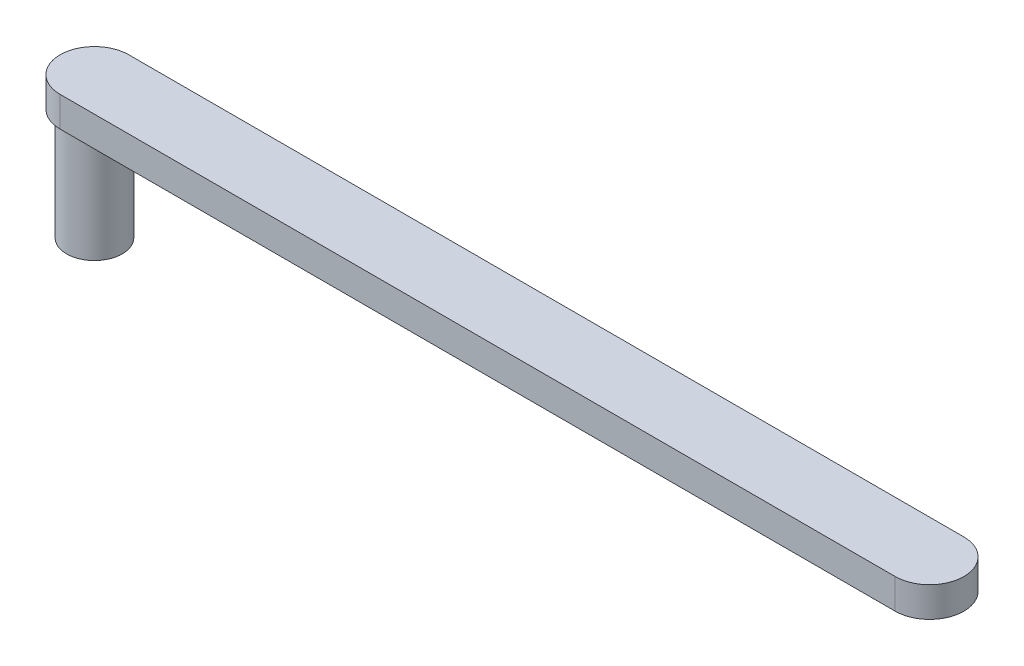
ISO-10303-21;
HEADER;
FILE_DESCRIPTION(('STEP AP214'),'2;1');
FILE_NAME('part.step','',(''),(''),'','','');
FILE_SCHEMA(('AUTOMOTIVE_DESIGN { 1 0 10303 214 1 1 1 1 }'));
ENDSEC;
DATA;
#1=APPLICATION_CONTEXT('core data for automotive mechanical design processes');
#2=APPLICATION_PROTOCOL_DEFINITION('international standard','automotive_design',2000,#1);
#3=PRODUCT_CONTEXT('',#1,'mechanical');
#4=PRODUCT('Part','Part','',(#3));
#5=PRODUCT_RELATED_PRODUCT_CATEGORY('part','',(#4));
#6=PRODUCT_DEFINITION_FORMATION('','',#4);
#7=PRODUCT_DEFINITION_CONTEXT('part definition',#1,'design');
#8=PRODUCT_DEFINITION('design','',#6,#7);
#9=PRODUCT_DEFINITION_SHAPE('','',#8);
#10=(LENGTH_UNIT() NAMED_UNIT(*) SI_UNIT(.MILLI.,.METRE.));
#11=(NAMED_UNIT(*) PLANE_ANGLE_UNIT() SI_UNIT($,.RADIAN.));
#12=(NAMED_UNIT(*) SI_UNIT($,.STERADIAN.) SOLID_ANGLE_UNIT());
#13=UNCERTAINTY_MEASURE_WITH_UNIT(LENGTH_MEASURE(1.E-05),#10,'distance_accuracy_value','');
#14=(GEOMETRIC_REPRESENTATION_CONTEXT(3) GLOBAL_UNCERTAINTY_ASSIGNED_CONTEXT((#13)) GLOBAL_UNIT_ASSIGNED_CONTEXT((#10,
#11,#12)) REPRESENTATION_CONTEXT('',''));
#15=CARTESIAN_POINT('',(0.,0.,0.));
#16=DIRECTION('',(0.,0.,1.));
#17=DIRECTION('',(1.,0.,0.));
#18=AXIS2_PLACEMENT_3D('',#15,#16,#17);
#19=CARTESIAN_POINT('',(0.,50.8,0.));
#20=DIRECTION('',(0.,-1.,0.));
#21=DIRECTION('',(0.,0.,-1.));
#22=AXIS2_PLACEMENT_3D('',#19,#20,#21);
#23=CYLINDRICAL_SURFACE('',#22,12.7);
#24=CARTESIAN_POINT('',(0.,50.8,0.));
#25=DIRECTION('',(0.,1.,0.));
#26=DIRECTION('',(0.,0.,1.));
#27=AXIS2_PLACEMENT_3D('',#24,#25,#26);
#28=CIRCLE('',#27,12.7);
#29=CARTESIAN_POINT('',(0.,50.8,12.7));
#30=VERTEX_POINT('',#29);
#31=EDGE_CURVE('E11',#30,#30,#28,.T.);
#32=ORIENTED_EDGE('',*,*,#31,.F.);
#33=EDGE_LOOP('',(#32));
#34=FACE_BOUND('',#33,.T.);
#35=CARTESIAN_POINT('',(0.,0.,0.));
#36=DIRECTION('',(0.,1.,0.));
#37=DIRECTION('',(0.,0.,1.));
#38=AXIS2_PLACEMENT_3D('',#35,#36,#37);
#39=CIRCLE('',#38,12.7);
#40=CARTESIAN_POINT('',(0.,0.,12.7));
#41=VERTEX_POINT('',#40);
#42=EDGE_CURVE('E35',#41,#41,#39,.T.);
#43=ORIENTED_EDGE('',*,*,#42,.T.);
#44=EDGE_LOOP('',(#43));
#45=FACE_BOUND('',#44,.T.);
#46=ADVANCED_FACE('F32',(#34,#45),#23,.T.);
#47=CARTESIAN_POINT('',(0.,0.,0.));
#48=DIRECTION('',(0.,1.,0.));
#49=DIRECTION('',(0.,0.,1.));
#50=AXIS2_PLACEMENT_3D('',#47,#48,#49);
#51=PLANE('',#50);
#52=ORIENTED_EDGE('',*,*,#42,.F.);
#53=EDGE_LOOP('',(#52));
#54=FACE_BOUND('',#53,.T.);
#55=ADVANCED_FACE('F111',(#54),#51,.F.);
#56=CARTESIAN_POINT('',(0.,64.516,0.));
#57=DIRECTION('',(0.,-1.,0.));
#58=DIRECTION('',(0.,0.,-1.));
#59=AXIS2_PLACEMENT_3D('',#56,#57,#58);
#60=CYLINDRICAL_SURFACE('',#59,15.6552680081461);
#61=CARTESIAN_POINT('',(0.,50.8,0.));
#62=DIRECTION('',(0.,1.,0.));
#63=DIRECTION('',(0.,0.,1.));
#64=AXIS2_PLACEMENT_3D('',#61,#62,#63);
#65=CIRCLE('',#64,15.6552680081461);
#66=CARTESIAN_POINT('',(0.,50.8,-15.6552680081461));
#67=VERTEX_POINT('',#66);
#68=CARTESIAN_POINT('',(0.,50.8,15.6552680081461));
#69=VERTEX_POINT('',#68);
#70=EDGE_CURVE('E99',#67,#69,#65,.T.);
#71=ORIENTED_EDGE('',*,*,#70,.T.);
#72=DIRECTION('',(0.,-1.,0.));
#73=VECTOR('',#72,1.);
#74=CARTESIAN_POINT('',(0.,64.516,15.6552680081461));
#75=LINE('',#74,#73);
#76=CARTESIAN_POINT('',(0.,64.516,15.6552680081461));
#77=VERTEX_POINT('',#76);
#78=EDGE_CURVE('E90',#77,#69,#75,.T.);
#79=ORIENTED_EDGE('',*,*,#78,.F.);
#80=CARTESIAN_POINT('',(0.,64.516,0.));
#81=DIRECTION('',(0.,1.,0.));
#82=DIRECTION('',(0.,0.,1.));
#83=AXIS2_PLACEMENT_3D('',#80,#81,#82);
#84=CIRCLE('',#83,15.6552680081461);
#85=CARTESIAN_POINT('',(0.,64.516,-15.6552680081461));
#86=VERTEX_POINT('',#85);
#87=EDGE_CURVE('E84',#86,#77,#84,.T.);
#88=ORIENTED_EDGE('',*,*,#87,.F.);
#89=DIRECTION('',(0.,-1.,0.));
#90=VECTOR('',#89,1.);
#91=CARTESIAN_POINT('',(0.,64.516,-15.6552680081461));
#92=LINE('',#91,#90);
#93=EDGE_CURVE('E95',#86,#67,#92,.T.);
#94=ORIENTED_EDGE('',*,*,#93,.T.);
#95=EDGE_LOOP('',(#71,#79,#88,#94));
#96=FACE_BOUND('',#95,.T.);
#97=ADVANCED_FACE('F113',(#96),#60,.T.);
#98=CARTESIAN_POINT('',(0.,64.516,15.6552680081461));
#99=DIRECTION('',(0.,0.,-1.));
#100=DIRECTION('',(-1.,0.,0.));
#101=AXIS2_PLACEMENT_3D('',#98,#99,#100);
#102=PLANE('',#101);
#103=DIRECTION('',(1.,0.,0.));
#104=VECTOR('',#103,1.);
#105=CARTESIAN_POINT('',(0.,50.8,15.6552680081461));
#106=LINE('',#105,#104);
#107=CARTESIAN_POINT('',(381.,50.8,15.6552680081461));
#108=VERTEX_POINT('',#107);
#109=EDGE_CURVE('E89',#69,#108,#106,.T.);
#110=ORIENTED_EDGE('',*,*,#109,.T.);
#111=DIRECTION('',(0.,-1.,0.));
#112=VECTOR('',#111,1.);
#113=CARTESIAN_POINT('',(381.,64.516,15.6552680081461));
#114=LINE('',#113,#112);
#115=CARTESIAN_POINT('',(381.,64.516,15.6552680081461));
#116=VERTEX_POINT('',#115);
#117=EDGE_CURVE('E87',#116,#108,#114,.T.);
#118=ORIENTED_EDGE('',*,*,#117,.F.);
#119=DIRECTION('',(1.,0.,0.));
#120=VECTOR('',#119,1.);
#121=CARTESIAN_POINT('',(0.,64.516,15.6552680081461));
#122=LINE('',#121,#120);
#123=EDGE_CURVE('E79',#77,#116,#122,.T.);
#124=ORIENTED_EDGE('',*,*,#123,.F.);
#125=ORIENTED_EDGE('',*,*,#78,.T.);
#126=EDGE_LOOP('',(#110,#118,#124,#125));
#127=FACE_BOUND('',#126,.T.);
#128=ADVANCED_FACE('F88',(#127),#102,.F.);
#129=CARTESIAN_POINT('',(381.,64.516,0.));
#130=DIRECTION('',(0.,-1.,0.));
#131=DIRECTION('',(0.,0.,-1.));
#132=AXIS2_PLACEMENT_3D('',#129,#130,#131);
#133=CYLINDRICAL_SURFACE('',#132,15.6552680081461);
#134=CARTESIAN_POINT('',(381.,50.8,0.));
#135=DIRECTION('',(0.,1.,0.));
#136=DIRECTION('',(0.,0.,1.));
#137=AXIS2_PLACEMENT_3D('',#134,#135,#136);
#138=CIRCLE('',#137,15.6552680081461);
#139=CARTESIAN_POINT('',(381.,50.8,-15.6552680081461));
#140=VERTEX_POINT('',#139);
#141=EDGE_CURVE('E65',#108,#140,#138,.T.);
#142=ORIENTED_EDGE('',*,*,#141,.T.);
#143=DIRECTION('',(0.,-1.,0.));
#144=VECTOR('',#143,1.);
#145=CARTESIAN_POINT('',(381.,64.516,-15.6552680081461));
#146=LINE('',#145,#144);
#147=CARTESIAN_POINT('',(381.,64.516,-15.6552680081461));
#148=VERTEX_POINT('',#147);
#149=EDGE_CURVE('E91',#148,#140,#146,.T.);
#150=ORIENTED_EDGE('',*,*,#149,.F.);
#151=CARTESIAN_POINT('',(381.,64.516,0.));
#152=DIRECTION('',(0.,1.,0.));
#153=DIRECTION('',(0.,0.,1.));
#154=AXIS2_PLACEMENT_3D('',#151,#152,#153);
#155=CIRCLE('',#154,15.6552680081461);
#156=EDGE_CURVE('E82',#116,#148,#155,.T.);
#157=ORIENTED_EDGE('',*,*,#156,.F.);
#158=ORIENTED_EDGE('',*,*,#117,.T.);
#159=EDGE_LOOP('',(#142,#150,#157,#158));
#160=FACE_BOUND('',#159,.T.);
#161=ADVANCED_FACE('F93',(#160),#133,.T.);
#162=CARTESIAN_POINT('',(0.,64.516,-15.6552680081461));
#163=DIRECTION('',(0.,0.,1.));
#164=DIRECTION('',(1.,0.,0.));
#165=AXIS2_PLACEMENT_3D('',#162,#163,#164);
#166=PLANE('',#165);
#167=DIRECTION('',(-1.,0.,0.));
#168=VECTOR('',#167,1.);
#169=CARTESIAN_POINT('',(0.,50.8,-15.6552680081461));
#170=LINE('',#169,#168);
#171=EDGE_CURVE('E71',#140,#67,#170,.T.);
#172=ORIENTED_EDGE('',*,*,#171,.T.);
#173=ORIENTED_EDGE('',*,*,#93,.F.);
#174=DIRECTION('',(-1.,0.,0.));
#175=VECTOR('',#174,1.);
#176=CARTESIAN_POINT('',(0.,64.516,-15.6552680081461));
#177=LINE('',#176,#175);
#178=EDGE_CURVE('E48',#148,#86,#177,.T.);
#179=ORIENTED_EDGE('',*,*,#178,.F.);
#180=ORIENTED_EDGE('',*,*,#149,.T.);
#181=EDGE_LOOP('',(#172,#173,#179,#180));
#182=FACE_BOUND('',#181,.T.);
#183=ADVANCED_FACE('F126',(#182),#166,.F.);
#184=CARTESIAN_POINT('',(0.,64.516,0.));
#185=DIRECTION('',(0.,1.,0.));
#186=DIRECTION('',(0.,0.,1.));
#187=AXIS2_PLACEMENT_3D('',#184,#185,#186);
#188=PLANE('',#187);
#189=ORIENTED_EDGE('',*,*,#87,.T.);
#190=ORIENTED_EDGE('',*,*,#123,.T.);
#191=ORIENTED_EDGE('',*,*,#156,.T.);
#192=ORIENTED_EDGE('',*,*,#178,.T.);
#193=EDGE_LOOP('',(#189,#190,#191,#192));
#194=FACE_BOUND('',#193,.T.);
#195=ADVANCED_FACE('F80',(#194),#188,.T.);
#196=CARTESIAN_POINT('',(0.,50.8,0.));
#197=DIRECTION('',(0.,1.,0.));
#198=DIRECTION('',(0.,0.,1.));
#199=AXIS2_PLACEMENT_3D('',#196,#197,#198);
#200=PLANE('',#199);
#201=ORIENTED_EDGE('',*,*,#31,.T.);
#202=EDGE_LOOP('',(#201));
#203=FACE_BOUND('',#202,.T.);
#204=ORIENTED_EDGE('',*,*,#70,.F.);
#205=ORIENTED_EDGE('',*,*,#171,.F.);
#206=ORIENTED_EDGE('',*,*,#141,.F.);
#207=ORIENTED_EDGE('',*,*,#109,.F.);
#208=EDGE_LOOP('',(#204,#205,#206,#207));
#209=FACE_BOUND('',#208,.T.);
#210=ADVANCED_FACE('F129',(#203,#209),#200,.F.);
#211=CLOSED_SHELL('',(#46,#55,#97,#128,#161,#183,#195,#210));
#212=MANIFOLD_SOLID_BREP('B2',#211);
#213=ADVANCED_BREP_SHAPE_REPRESENTATION('',(#18,#212),#14);
#214=SHAPE_DEFINITION_REPRESENTATION(#9,#213);
ENDSEC;
END-ISO-10303-21;
